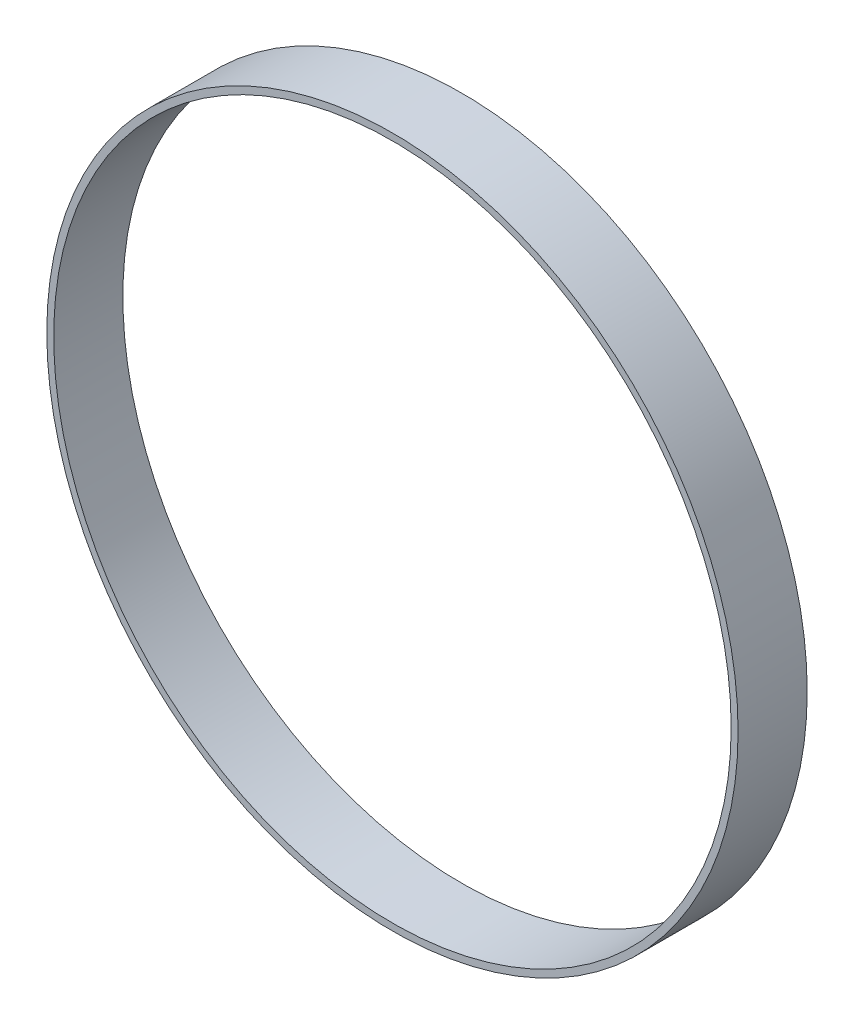
ISO-10303-21;
HEADER;
FILE_DESCRIPTION(('STEP AP214'),'2;1');
FILE_NAME('part.step','',(''),(''),'','','');
FILE_SCHEMA(('AUTOMOTIVE_DESIGN { 1 0 10303 214 1 1 1 1 }'));
ENDSEC;
DATA;
#1=APPLICATION_CONTEXT('core data for automotive mechanical design processes');
#2=APPLICATION_PROTOCOL_DEFINITION('international standard','automotive_design',2000,#1);
#3=PRODUCT_CONTEXT('',#1,'mechanical');
#4=PRODUCT('Part','Part','',(#3));
#5=PRODUCT_RELATED_PRODUCT_CATEGORY('part','',(#4));
#6=PRODUCT_DEFINITION_FORMATION('','',#4);
#7=PRODUCT_DEFINITION_CONTEXT('part definition',#1,'design');
#8=PRODUCT_DEFINITION('design','',#6,#7);
#9=PRODUCT_DEFINITION_SHAPE('','',#8);
#10=(LENGTH_UNIT() NAMED_UNIT(*) SI_UNIT(.MILLI.,.METRE.));
#11=(NAMED_UNIT(*) PLANE_ANGLE_UNIT() SI_UNIT($,.RADIAN.));
#12=(NAMED_UNIT(*) SI_UNIT($,.STERADIAN.) SOLID_ANGLE_UNIT());
#13=UNCERTAINTY_MEASURE_WITH_UNIT(LENGTH_MEASURE(1.E-05),#10,'distance_accuracy_value','');
#14=(GEOMETRIC_REPRESENTATION_CONTEXT(3) GLOBAL_UNCERTAINTY_ASSIGNED_CONTEXT((#13)) GLOBAL_UNIT_ASSIGNED_CONTEXT((#10,
#11,#12)) REPRESENTATION_CONTEXT('',''));
#15=CARTESIAN_POINT('',(0.,0.,0.));
#16=DIRECTION('',(0.,0.,1.));
#17=DIRECTION('',(1.,0.,0.));
#18=AXIS2_PLACEMENT_3D('',#15,#16,#17);
#19=CARTESIAN_POINT('',(0.,0.,20.));
#20=DIRECTION('',(0.,0.,1.));
#21=DIRECTION('',(1.,0.,0.));
#22=AXIS2_PLACEMENT_3D('',#19,#20,#21);
#23=PLANE('',#22);
#24=CARTESIAN_POINT('',(0.,0.,20.));
#25=DIRECTION('',(0.,0.,1.));
#26=DIRECTION('',(1.,0.,0.));
#27=AXIS2_PLACEMENT_3D('',#24,#25,#26);
#28=CIRCLE('',#27,100.);
#29=CARTESIAN_POINT('',(100.,0.,20.));
#30=VERTEX_POINT('',#29);
#31=EDGE_CURVE('E10',#30,#30,#28,.T.);
#32=ORIENTED_EDGE('',*,*,#31,.T.);
#33=EDGE_LOOP('',(#32));
#34=FACE_BOUND('',#33,.T.);
#35=CARTESIAN_POINT('',(0.,0.,20.));
#36=DIRECTION('',(0.,0.,1.));
#37=DIRECTION('',(1.,0.,0.));
#38=AXIS2_PLACEMENT_3D('',#35,#36,#37);
#39=CIRCLE('',#38,98.);
#40=CARTESIAN_POINT('',(98.,0.,20.));
#41=VERTEX_POINT('',#40);
#42=EDGE_CURVE('E50',#41,#41,#39,.T.);
#43=ORIENTED_EDGE('',*,*,#42,.F.);
#44=EDGE_LOOP('',(#43));
#45=FACE_BOUND('',#44,.T.);
#46=ADVANCED_FACE('F37',(#34,#45),#23,.T.);
#47=CARTESIAN_POINT('',(0.,0.,0.));
#48=DIRECTION('',(0.,0.,1.));
#49=DIRECTION('',(1.,0.,0.));
#50=AXIS2_PLACEMENT_3D('',#47,#48,#49);
#51=PLANE('',#50);
#52=CARTESIAN_POINT('',(0.,0.,0.));
#53=DIRECTION('',(0.,0.,1.));
#54=DIRECTION('',(1.,0.,0.));
#55=AXIS2_PLACEMENT_3D('',#52,#53,#54);
#56=CIRCLE('',#55,100.);
#57=CARTESIAN_POINT('',(100.,0.,0.));
#58=VERTEX_POINT('',#57);
#59=EDGE_CURVE('E41',#58,#58,#56,.T.);
#60=ORIENTED_EDGE('',*,*,#59,.F.);
#61=EDGE_LOOP('',(#60));
#62=FACE_BOUND('',#61,.T.);
#63=CARTESIAN_POINT('',(0.,0.,0.));
#64=DIRECTION('',(0.,0.,1.));
#65=DIRECTION('',(1.,0.,0.));
#66=AXIS2_PLACEMENT_3D('',#63,#64,#65);
#67=CIRCLE('',#66,98.);
#68=CARTESIAN_POINT('',(98.,0.,0.));
#69=VERTEX_POINT('',#68);
#70=EDGE_CURVE('E52',#69,#69,#67,.T.);
#71=ORIENTED_EDGE('',*,*,#70,.T.);
#72=EDGE_LOOP('',(#71));
#73=FACE_BOUND('',#72,.T.);
#74=ADVANCED_FACE('F64',(#62,#73),#51,.F.);
#75=CARTESIAN_POINT('',(0.,0.,20.));
#76=DIRECTION('',(0.,0.,-1.));
#77=DIRECTION('',(-1.,0.,0.));
#78=AXIS2_PLACEMENT_3D('',#75,#76,#77);
#79=CYLINDRICAL_SURFACE('',#78,100.);
#80=ORIENTED_EDGE('',*,*,#31,.F.);
#81=EDGE_LOOP('',(#80));
#82=FACE_BOUND('',#81,.T.);
#83=ORIENTED_EDGE('',*,*,#59,.T.);
#84=EDGE_LOOP('',(#83));
#85=FACE_BOUND('',#84,.T.);
#86=ADVANCED_FACE('F39',(#82,#85),#79,.T.);
#87=CARTESIAN_POINT('',(0.,0.,20.));
#88=DIRECTION('',(0.,0.,-1.));
#89=DIRECTION('',(-1.,0.,0.));
#90=AXIS2_PLACEMENT_3D('',#87,#88,#89);
#91=CYLINDRICAL_SURFACE('',#90,98.);
#92=ORIENTED_EDGE('',*,*,#42,.T.);
#93=EDGE_LOOP('',(#92));
#94=FACE_BOUND('',#93,.T.);
#95=ORIENTED_EDGE('',*,*,#70,.F.);
#96=EDGE_LOOP('',(#95));
#97=FACE_BOUND('',#96,.T.);
#98=ADVANCED_FACE('F60',(#94,#97),#91,.F.);
#99=CLOSED_SHELL('',(#46,#74,#86,#98));
#100=MANIFOLD_SOLID_BREP('B2',#99);
#101=ADVANCED_BREP_SHAPE_REPRESENTATION('',(#18,#100),#14);
#102=SHAPE_DEFINITION_REPRESENTATION(#9,#101);
ENDSEC;
END-ISO-10303-21;
